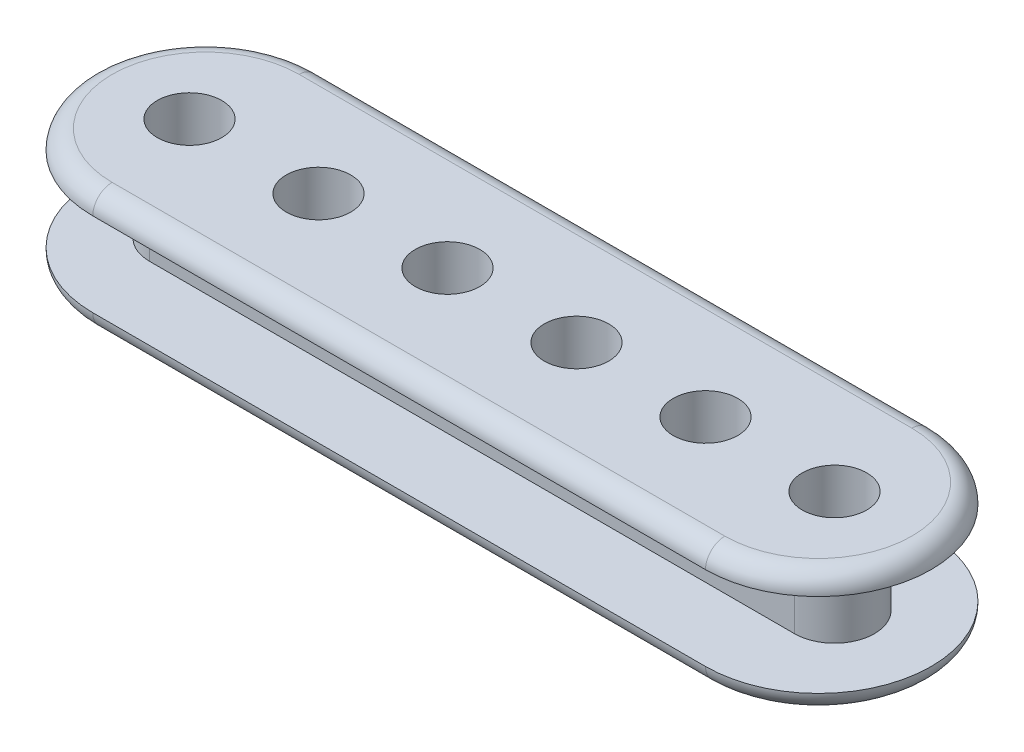
ISO-10303-21;
HEADER;
FILE_DESCRIPTION(('STEP AP214'),'2;1');
FILE_NAME('part.step','',(''),(''),'','','');
FILE_SCHEMA(('AUTOMOTIVE_DESIGN { 1 0 10303 214 1 1 1 1 }'));
ENDSEC;
DATA;
#1=APPLICATION_CONTEXT('core data for automotive mechanical design processes');
#2=APPLICATION_PROTOCOL_DEFINITION('international standard','automotive_design',2000,#1);
#3=PRODUCT_CONTEXT('',#1,'mechanical');
#4=PRODUCT('Part','Part','',(#3));
#5=PRODUCT_RELATED_PRODUCT_CATEGORY('part','',(#4));
#6=PRODUCT_DEFINITION_FORMATION('','',#4);
#7=PRODUCT_DEFINITION_CONTEXT('part definition',#1,'design');
#8=PRODUCT_DEFINITION('design','',#6,#7);
#9=PRODUCT_DEFINITION_SHAPE('','',#8);
#10=(LENGTH_UNIT() NAMED_UNIT(*) SI_UNIT(.MILLI.,.METRE.));
#11=(NAMED_UNIT(*) PLANE_ANGLE_UNIT() SI_UNIT($,.RADIAN.));
#12=(NAMED_UNIT(*) SI_UNIT($,.STERADIAN.) SOLID_ANGLE_UNIT());
#13=UNCERTAINTY_MEASURE_WITH_UNIT(LENGTH_MEASURE(1.E-05),#10,'distance_accuracy_value','');
#14=(GEOMETRIC_REPRESENTATION_CONTEXT(3) GLOBAL_UNCERTAINTY_ASSIGNED_CONTEXT((#13)) GLOBAL_UNIT_ASSIGNED_CONTEXT((#10,
#11,#12)) REPRESENTATION_CONTEXT('',''));
#15=CARTESIAN_POINT('',(0.,0.,0.));
#16=DIRECTION('',(0.,0.,1.));
#17=DIRECTION('',(1.,0.,0.));
#18=AXIS2_PLACEMENT_3D('',#15,#16,#17);
#19=CARTESIAN_POINT('',(24.13,1.524,0.));
#20=DIRECTION('',(0.,1.,0.));
#21=DIRECTION('',(0.,0.,1.));
#22=AXIS2_PLACEMENT_3D('',#19,#20,#21);
#23=PLANE('',#22);
#24=DIRECTION('',(1.,0.,0.));
#25=VECTOR('',#24,1.);
#26=CARTESIAN_POINT('',(0.,1.524,3.1496));
#27=LINE('',#26,#25);
#28=CARTESIAN_POINT('',(-25.4,1.524,3.1496));
#29=VERTEX_POINT('',#28);
#30=CARTESIAN_POINT('',(25.4,1.524,3.1496));
#31=VERTEX_POINT('',#30);
#32=EDGE_CURVE('E230',#29,#31,#27,.T.);
#33=ORIENTED_EDGE('',*,*,#32,.F.);
#34=CARTESIAN_POINT('',(-25.4,1.524,0.));
#35=DIRECTION('',(0.,1.,0.));
#36=DIRECTION('',(0.,0.,1.));
#37=AXIS2_PLACEMENT_3D('',#34,#35,#36);
#38=CIRCLE('',#37,3.1496);
#39=CARTESIAN_POINT('',(-25.4,1.524,-3.1496));
#40=VERTEX_POINT('',#39);
#41=EDGE_CURVE('E236',#40,#29,#38,.T.);
#42=ORIENTED_EDGE('',*,*,#41,.F.);
#43=DIRECTION('',(1.,0.,0.));
#44=VECTOR('',#43,1.);
#45=CARTESIAN_POINT('',(0.,1.524,-3.1496));
#46=LINE('',#45,#44);
#47=CARTESIAN_POINT('',(25.4,1.524,-3.1496));
#48=VERTEX_POINT('',#47);
#49=EDGE_CURVE('E256',#40,#48,#46,.T.);
#50=ORIENTED_EDGE('',*,*,#49,.T.);
#51=CARTESIAN_POINT('',(25.4,1.524,0.));
#52=DIRECTION('',(0.,1.,0.));
#53=DIRECTION('',(0.,0.,1.));
#54=AXIS2_PLACEMENT_3D('',#51,#52,#53);
#55=CIRCLE('',#54,3.1496);
#56=EDGE_CURVE('E252',#31,#48,#55,.T.);
#57=ORIENTED_EDGE('',*,*,#56,.F.);
#58=EDGE_LOOP('',(#33,#42,#50,#57));
#59=FACE_BOUND('',#58,.T.);
#60=CARTESIAN_POINT('',(24.13,1.524,0.));
#61=DIRECTION('',(0.,1.,0.));
#62=DIRECTION('',(0.,0.,1.));
#63=AXIS2_PLACEMENT_3D('',#60,#61,#62);
#64=CIRCLE('',#63,8.89);
#65=CARTESIAN_POINT('',(24.13,1.524,8.88999999999999));
#66=VERTEX_POINT('',#65);
#67=CARTESIAN_POINT('',(24.13,1.524,-8.89000000000001));
#68=VERTEX_POINT('',#67);
#69=EDGE_CURVE('E277',#66,#68,#64,.T.);
#70=ORIENTED_EDGE('',*,*,#69,.T.);
#71=DIRECTION('',(-1.,0.,0.));
#72=VECTOR('',#71,1.);
#73=CARTESIAN_POINT('',(24.13,1.524,-8.89000000000001));
#74=LINE('',#73,#72);
#75=CARTESIAN_POINT('',(-24.13,1.524,-8.89));
#76=VERTEX_POINT('',#75);
#77=EDGE_CURVE('E281',#68,#76,#74,.T.);
#78=ORIENTED_EDGE('',*,*,#77,.T.);
#79=CARTESIAN_POINT('',(-24.13,1.524,0.));
#80=DIRECTION('',(0.,1.,0.));
#81=DIRECTION('',(0.,0.,1.));
#82=AXIS2_PLACEMENT_3D('',#79,#80,#81);
#83=CIRCLE('',#82,8.89);
#84=CARTESIAN_POINT('',(-24.13,1.524,8.89));
#85=VERTEX_POINT('',#84);
#86=EDGE_CURVE('E284',#76,#85,#83,.T.);
#87=ORIENTED_EDGE('',*,*,#86,.T.);
#88=DIRECTION('',(1.,0.,0.));
#89=VECTOR('',#88,1.);
#90=CARTESIAN_POINT('',(24.13,1.524,8.88999999999999));
#91=LINE('',#90,#89);
#92=EDGE_CURVE('E287',#85,#66,#91,.T.);
#93=ORIENTED_EDGE('',*,*,#92,.T.);
#94=EDGE_LOOP('',(#70,#78,#87,#93));
#95=FACE_BOUND('',#94,.T.);
#96=ADVANCED_FACE('F41',(#59,#95),#23,.T.);
#97=CARTESIAN_POINT('',(24.13,0.,0.));
#98=DIRECTION('',(0.,1.,0.));
#99=DIRECTION('',(0.,0.,1.));
#100=AXIS2_PLACEMENT_3D('',#97,#98,#99);
#101=PLANE('',#100);
#102=CARTESIAN_POINT('',(-25.4,0.,0.));
#103=DIRECTION('',(0.,1.,0.));
#104=DIRECTION('',(0.,0.,1.));
#105=AXIS2_PLACEMENT_3D('',#102,#103,#104);
#106=CIRCLE('',#105,2.54);
#107=CARTESIAN_POINT('',(-25.4,0.,2.54));
#108=VERTEX_POINT('',#107);
#109=EDGE_CURVE('E175',#108,#108,#106,.T.);
#110=ORIENTED_EDGE('',*,*,#109,.T.);
#111=EDGE_LOOP('',(#110));
#112=FACE_BOUND('',#111,.T.);
#113=CARTESIAN_POINT('',(-15.24,0.,0.));
#114=DIRECTION('',(0.,1.,0.));
#115=DIRECTION('',(0.,0.,1.));
#116=AXIS2_PLACEMENT_3D('',#113,#114,#115);
#117=CIRCLE('',#116,2.54);
#118=CARTESIAN_POINT('',(-15.24,0.,2.54));
#119=VERTEX_POINT('',#118);
#120=EDGE_CURVE('E536',#119,#119,#117,.T.);
#121=ORIENTED_EDGE('',*,*,#120,.T.);
#122=EDGE_LOOP('',(#121));
#123=FACE_BOUND('',#122,.T.);
#124=CARTESIAN_POINT('',(-5.07999999999999,0.,0.));
#125=DIRECTION('',(0.,1.,0.));
#126=DIRECTION('',(0.,0.,1.));
#127=AXIS2_PLACEMENT_3D('',#124,#125,#126);
#128=CIRCLE('',#127,2.54);
#129=CARTESIAN_POINT('',(-5.07999999999999,0.,2.54));
#130=VERTEX_POINT('',#129);
#131=EDGE_CURVE('E540',#130,#130,#128,.T.);
#132=ORIENTED_EDGE('',*,*,#131,.T.);
#133=EDGE_LOOP('',(#132));
#134=FACE_BOUND('',#133,.T.);
#135=CARTESIAN_POINT('',(5.08,0.,0.));
#136=DIRECTION('',(0.,1.,0.));
#137=DIRECTION('',(0.,0.,1.));
#138=AXIS2_PLACEMENT_3D('',#135,#136,#137);
#139=CIRCLE('',#138,2.54);
#140=CARTESIAN_POINT('',(5.08,0.,2.54));
#141=VERTEX_POINT('',#140);
#142=EDGE_CURVE('E221',#141,#141,#139,.T.);
#143=ORIENTED_EDGE('',*,*,#142,.T.);
#144=EDGE_LOOP('',(#143));
#145=FACE_BOUND('',#144,.T.);
#146=CARTESIAN_POINT('',(15.24,0.,0.));
#147=DIRECTION('',(0.,1.,0.));
#148=DIRECTION('',(0.,0.,1.));
#149=AXIS2_PLACEMENT_3D('',#146,#147,#148);
#150=CIRCLE('',#149,2.54);
#151=CARTESIAN_POINT('',(15.24,0.,2.54));
#152=VERTEX_POINT('',#151);
#153=EDGE_CURVE('E217',#152,#152,#150,.T.);
#154=ORIENTED_EDGE('',*,*,#153,.T.);
#155=EDGE_LOOP('',(#154));
#156=FACE_BOUND('',#155,.T.);
#157=CARTESIAN_POINT('',(25.4,0.,0.));
#158=DIRECTION('',(0.,1.,0.));
#159=DIRECTION('',(0.,0.,1.));
#160=AXIS2_PLACEMENT_3D('',#157,#158,#159);
#161=CIRCLE('',#160,2.54);
#162=CARTESIAN_POINT('',(25.4,0.,2.54));
#163=VERTEX_POINT('',#162);
#164=EDGE_CURVE('E214',#163,#163,#161,.T.);
#165=ORIENTED_EDGE('',*,*,#164,.T.);
#166=EDGE_LOOP('',(#165));
#167=FACE_BOUND('',#166,.T.);
#168=DIRECTION('',(-1.,0.,0.));
#169=VECTOR('',#168,1.);
#170=CARTESIAN_POINT('',(24.13,0.,-7.36600000000001));
#171=LINE('',#170,#169);
#172=CARTESIAN_POINT('',(-24.13,0.,-7.366));
#173=VERTEX_POINT('',#172);
#174=CARTESIAN_POINT('',(24.13,0.,-7.36600000000001));
#175=VERTEX_POINT('',#174);
#176=EDGE_CURVE('E296',#173,#175,#171,.F.);
#177=ORIENTED_EDGE('',*,*,#176,.T.);
#178=CARTESIAN_POINT('',(24.13,0.,0.));
#179=DIRECTION('',(0.,1.,0.));
#180=DIRECTION('',(0.,0.,1.));
#181=AXIS2_PLACEMENT_3D('',#178,#179,#180);
#182=CIRCLE('',#181,7.366);
#183=CARTESIAN_POINT('',(24.13,0.,7.36599999999999));
#184=VERTEX_POINT('',#183);
#185=EDGE_CURVE('E299',#175,#184,#182,.F.);
#186=ORIENTED_EDGE('',*,*,#185,.T.);
#187=DIRECTION('',(1.,0.,0.));
#188=VECTOR('',#187,1.);
#189=CARTESIAN_POINT('',(24.13,0.,7.36599999999999));
#190=LINE('',#189,#188);
#191=CARTESIAN_POINT('',(-24.13,0.,7.366));
#192=VERTEX_POINT('',#191);
#193=EDGE_CURVE('E293',#184,#192,#190,.F.);
#194=ORIENTED_EDGE('',*,*,#193,.T.);
#195=CARTESIAN_POINT('',(-24.13,0.,0.));
#196=DIRECTION('',(0.,1.,0.));
#197=DIRECTION('',(0.,0.,1.));
#198=AXIS2_PLACEMENT_3D('',#195,#196,#197);
#199=CIRCLE('',#198,7.366);
#200=EDGE_CURVE('E290',#192,#173,#199,.F.);
#201=ORIENTED_EDGE('',*,*,#200,.T.);
#202=EDGE_LOOP('',(#177,#186,#194,#201));
#203=FACE_BOUND('',#202,.T.);
#204=ADVANCED_FACE('F333',(#112,#123,#134,#145,#156,#167,#203),#101,.F.);
#205=CARTESIAN_POINT('',(0.,8.128,3.1496));
#206=DIRECTION('',(0.,0.,-1.));
#207=DIRECTION('',(-1.,0.,0.));
#208=AXIS2_PLACEMENT_3D('',#205,#206,#207);
#209=PLANE('',#208);
#210=ORIENTED_EDGE('',*,*,#32,.T.);
#211=DIRECTION('',(0.,-1.,0.));
#212=VECTOR('',#211,1.);
#213=CARTESIAN_POINT('',(25.4,8.128,3.1496));
#214=LINE('',#213,#212);
#215=CARTESIAN_POINT('',(25.4,8.128,3.1496));
#216=VERTEX_POINT('',#215);
#217=EDGE_CURVE('E273',#216,#31,#214,.T.);
#218=ORIENTED_EDGE('',*,*,#217,.F.);
#219=DIRECTION('',(1.,0.,0.));
#220=VECTOR('',#219,1.);
#221=CARTESIAN_POINT('',(0.,8.128,3.1496));
#222=LINE('',#221,#220);
#223=CARTESIAN_POINT('',(-25.4,8.128,3.1496));
#224=VERTEX_POINT('',#223);
#225=EDGE_CURVE('E231',#224,#216,#222,.T.);
#226=ORIENTED_EDGE('',*,*,#225,.F.);
#227=DIRECTION('',(0.,-1.,0.));
#228=VECTOR('',#227,1.);
#229=CARTESIAN_POINT('',(-25.4,8.128,3.1496));
#230=LINE('',#229,#228);
#231=EDGE_CURVE('E248',#224,#29,#230,.T.);
#232=ORIENTED_EDGE('',*,*,#231,.T.);
#233=EDGE_LOOP('',(#210,#218,#226,#232));
#234=FACE_BOUND('',#233,.T.);
#235=ADVANCED_FACE('F347',(#234),#209,.F.);
#236=CARTESIAN_POINT('',(25.4,8.128,0.));
#237=DIRECTION('',(0.,-1.,0.));
#238=DIRECTION('',(0.,0.,-1.));
#239=AXIS2_PLACEMENT_3D('',#236,#237,#238);
#240=CYLINDRICAL_SURFACE('',#239,3.1496);
#241=ORIENTED_EDGE('',*,*,#56,.T.);
#242=DIRECTION('',(0.,-1.,0.));
#243=VECTOR('',#242,1.);
#244=CARTESIAN_POINT('',(25.4,8.128,-3.1496));
#245=LINE('',#244,#243);
#246=CARTESIAN_POINT('',(25.4,8.128,-3.1496));
#247=VERTEX_POINT('',#246);
#248=EDGE_CURVE('E269',#247,#48,#245,.T.);
#249=ORIENTED_EDGE('',*,*,#248,.F.);
#250=CARTESIAN_POINT('',(25.4,8.128,0.));
#251=DIRECTION('',(0.,1.,0.));
#252=DIRECTION('',(0.,0.,1.));
#253=AXIS2_PLACEMENT_3D('',#250,#251,#252);
#254=CIRCLE('',#253,3.1496);
#255=EDGE_CURVE('E235',#216,#247,#254,.T.);
#256=ORIENTED_EDGE('',*,*,#255,.F.);
#257=ORIENTED_EDGE('',*,*,#217,.T.);
#258=EDGE_LOOP('',(#241,#249,#256,#257));
#259=FACE_BOUND('',#258,.T.);
#260=ADVANCED_FACE('F419',(#259),#240,.T.);
#261=CARTESIAN_POINT('',(0.,8.128,-3.1496));
#262=DIRECTION('',(0.,0.,-1.));
#263=DIRECTION('',(-1.,0.,0.));
#264=AXIS2_PLACEMENT_3D('',#261,#262,#263);
#265=PLANE('',#264);
#266=ORIENTED_EDGE('',*,*,#49,.F.);
#267=DIRECTION('',(0.,-1.,0.));
#268=VECTOR('',#267,1.);
#269=CARTESIAN_POINT('',(-25.4,8.128,-3.1496));
#270=LINE('',#269,#268);
#271=CARTESIAN_POINT('',(-25.4,8.128,-3.1496));
#272=VERTEX_POINT('',#271);
#273=EDGE_CURVE('E265',#272,#40,#270,.T.);
#274=ORIENTED_EDGE('',*,*,#273,.F.);
#275=DIRECTION('',(1.,0.,0.));
#276=VECTOR('',#275,1.);
#277=CARTESIAN_POINT('',(0.,8.128,-3.1496));
#278=LINE('',#277,#276);
#279=EDGE_CURVE('E240',#272,#247,#278,.T.);
#280=ORIENTED_EDGE('',*,*,#279,.T.);
#281=ORIENTED_EDGE('',*,*,#248,.T.);
#282=EDGE_LOOP('',(#266,#274,#280,#281));
#283=FACE_BOUND('',#282,.T.);
#284=ADVANCED_FACE('F411',(#283),#265,.T.);
#285=CARTESIAN_POINT('',(-25.4,8.128,0.));
#286=DIRECTION('',(0.,-1.,0.));
#287=DIRECTION('',(0.,0.,-1.));
#288=AXIS2_PLACEMENT_3D('',#285,#286,#287);
#289=CYLINDRICAL_SURFACE('',#288,3.1496);
#290=ORIENTED_EDGE('',*,*,#41,.T.);
#291=ORIENTED_EDGE('',*,*,#231,.F.);
#292=CARTESIAN_POINT('',(-25.4,8.128,0.));
#293=DIRECTION('',(0.,1.,0.));
#294=DIRECTION('',(0.,0.,1.));
#295=AXIS2_PLACEMENT_3D('',#292,#293,#294);
#296=CIRCLE('',#295,3.1496);
#297=EDGE_CURVE('E244',#272,#224,#296,.T.);
#298=ORIENTED_EDGE('',*,*,#297,.F.);
#299=ORIENTED_EDGE('',*,*,#273,.T.);
#300=EDGE_LOOP('',(#290,#291,#298,#299));
#301=FACE_BOUND('',#300,.T.);
#302=ADVANCED_FACE('F403',(#301),#289,.T.);
#303=CARTESIAN_POINT('',(24.13,8.128,0.));
#304=DIRECTION('',(0.,1.,0.));
#305=DIRECTION('',(0.,0.,1.));
#306=AXIS2_PLACEMENT_3D('',#303,#304,#305);
#307=PLANE('',#306);
#308=ORIENTED_EDGE('',*,*,#297,.T.);
#309=ORIENTED_EDGE('',*,*,#225,.T.);
#310=ORIENTED_EDGE('',*,*,#255,.T.);
#311=ORIENTED_EDGE('',*,*,#279,.F.);
#312=EDGE_LOOP('',(#308,#309,#310,#311));
#313=FACE_BOUND('',#312,.T.);
#314=CARTESIAN_POINT('',(24.13,8.128,0.));
#315=DIRECTION('',(0.,1.,0.));
#316=DIRECTION('',(0.,0.,1.));
#317=AXIS2_PLACEMENT_3D('',#314,#315,#316);
#318=CIRCLE('',#317,8.89);
#319=CARTESIAN_POINT('',(24.13,8.128,8.88999999999999));
#320=VERTEX_POINT('',#319);
#321=CARTESIAN_POINT('',(24.13,8.128,-8.89000000000001));
#322=VERTEX_POINT('',#321);
#323=EDGE_CURVE('E136',#320,#322,#318,.T.);
#324=ORIENTED_EDGE('',*,*,#323,.F.);
#325=DIRECTION('',(1.,0.,0.));
#326=VECTOR('',#325,1.);
#327=CARTESIAN_POINT('',(-24.13,8.128,8.89));
#328=LINE('',#327,#326);
#329=CARTESIAN_POINT('',(-24.13,8.128,8.89));
#330=VERTEX_POINT('',#329);
#331=EDGE_CURVE('E227',#330,#320,#328,.T.);
#332=ORIENTED_EDGE('',*,*,#331,.F.);
#333=CARTESIAN_POINT('',(-24.13,8.128,0.));
#334=DIRECTION('',(0.,1.,0.));
#335=DIRECTION('',(0.,0.,1.));
#336=AXIS2_PLACEMENT_3D('',#333,#334,#335);
#337=CIRCLE('',#336,8.89);
#338=CARTESIAN_POINT('',(-24.13,8.128,-8.89));
#339=VERTEX_POINT('',#338);
#340=EDGE_CURVE('E138',#339,#330,#337,.T.);
#341=ORIENTED_EDGE('',*,*,#340,.F.);
#342=DIRECTION('',(-1.,0.,0.));
#343=VECTOR('',#342,1.);
#344=CARTESIAN_POINT('',(24.13,8.128,-8.89000000000001));
#345=LINE('',#344,#343);
#346=EDGE_CURVE('E134',#322,#339,#345,.T.);
#347=ORIENTED_EDGE('',*,*,#346,.F.);
#348=EDGE_LOOP('',(#324,#332,#341,#347));
#349=FACE_BOUND('',#348,.T.);
#350=ADVANCED_FACE('F135',(#313,#349),#307,.F.);
#351=CARTESIAN_POINT('',(24.13,9.652,0.));
#352=DIRECTION('',(0.,1.,0.));
#353=DIRECTION('',(0.,0.,1.));
#354=AXIS2_PLACEMENT_3D('',#351,#352,#353);
#355=PLANE('',#354);
#356=CARTESIAN_POINT('',(-25.4,9.652,0.));
#357=DIRECTION('',(0.,1.,0.));
#358=DIRECTION('',(0.,0.,1.));
#359=AXIS2_PLACEMENT_3D('',#356,#357,#358);
#360=CIRCLE('',#359,2.54);
#361=CARTESIAN_POINT('',(-25.4,9.652,2.54));
#362=VERTEX_POINT('',#361);
#363=EDGE_CURVE('E45',#362,#362,#360,.T.);
#364=ORIENTED_EDGE('',*,*,#363,.F.);
#365=EDGE_LOOP('',(#364));
#366=FACE_BOUND('',#365,.T.);
#367=CARTESIAN_POINT('',(-15.24,9.652,0.));
#368=DIRECTION('',(0.,1.,0.));
#369=DIRECTION('',(0.,0.,1.));
#370=AXIS2_PLACEMENT_3D('',#367,#368,#369);
#371=CIRCLE('',#370,2.54);
#372=CARTESIAN_POINT('',(-15.24,9.652,2.54));
#373=VERTEX_POINT('',#372);
#374=EDGE_CURVE('E159',#373,#373,#371,.T.);
#375=ORIENTED_EDGE('',*,*,#374,.F.);
#376=EDGE_LOOP('',(#375));
#377=FACE_BOUND('',#376,.T.);
#378=CARTESIAN_POINT('',(-5.07999999999999,9.652,0.));
#379=DIRECTION('',(0.,1.,0.));
#380=DIRECTION('',(0.,0.,1.));
#381=AXIS2_PLACEMENT_3D('',#378,#379,#380);
#382=CIRCLE('',#381,2.54);
#383=CARTESIAN_POINT('',(-5.07999999999999,9.652,2.54));
#384=VERTEX_POINT('',#383);
#385=EDGE_CURVE('E183',#384,#384,#382,.T.);
#386=ORIENTED_EDGE('',*,*,#385,.F.);
#387=EDGE_LOOP('',(#386));
#388=FACE_BOUND('',#387,.T.);
#389=CARTESIAN_POINT('',(5.08,9.652,0.));
#390=DIRECTION('',(0.,1.,0.));
#391=DIRECTION('',(0.,0.,1.));
#392=AXIS2_PLACEMENT_3D('',#389,#390,#391);
#393=CIRCLE('',#392,2.54);
#394=CARTESIAN_POINT('',(5.08,9.652,2.54));
#395=VERTEX_POINT('',#394);
#396=EDGE_CURVE('E179',#395,#395,#393,.T.);
#397=ORIENTED_EDGE('',*,*,#396,.F.);
#398=EDGE_LOOP('',(#397));
#399=FACE_BOUND('',#398,.T.);
#400=CARTESIAN_POINT('',(15.24,9.652,0.));
#401=DIRECTION('',(0.,1.,0.));
#402=DIRECTION('',(0.,0.,1.));
#403=AXIS2_PLACEMENT_3D('',#400,#401,#402);
#404=CIRCLE('',#403,2.54);
#405=CARTESIAN_POINT('',(15.24,9.652,2.54));
#406=VERTEX_POINT('',#405);
#407=EDGE_CURVE('E174',#406,#406,#404,.T.);
#408=ORIENTED_EDGE('',*,*,#407,.F.);
#409=EDGE_LOOP('',(#408));
#410=FACE_BOUND('',#409,.T.);
#411=CARTESIAN_POINT('',(25.4,9.652,0.));
#412=DIRECTION('',(0.,1.,0.));
#413=DIRECTION('',(0.,0.,1.));
#414=AXIS2_PLACEMENT_3D('',#411,#412,#413);
#415=CIRCLE('',#414,2.54);
#416=CARTESIAN_POINT('',(25.4,9.652,2.54));
#417=VERTEX_POINT('',#416);
#418=EDGE_CURVE('E170',#417,#417,#415,.T.);
#419=ORIENTED_EDGE('',*,*,#418,.F.);
#420=EDGE_LOOP('',(#419));
#421=FACE_BOUND('',#420,.T.);
#422=DIRECTION('',(1.,0.,0.));
#423=VECTOR('',#422,1.);
#424=CARTESIAN_POINT('',(24.13,9.652,7.36599999999999));
#425=LINE('',#424,#423);
#426=CARTESIAN_POINT('',(-24.13,9.652,7.366));
#427=VERTEX_POINT('',#426);
#428=CARTESIAN_POINT('',(24.13,9.652,7.36599999999999));
#429=VERTEX_POINT('',#428);
#430=EDGE_CURVE('E51',#427,#429,#425,.T.);
#431=ORIENTED_EDGE('',*,*,#430,.T.);
#432=CARTESIAN_POINT('',(24.13,9.652,0.));
#433=DIRECTION('',(0.,1.,0.));
#434=DIRECTION('',(0.,0.,1.));
#435=AXIS2_PLACEMENT_3D('',#432,#433,#434);
#436=CIRCLE('',#435,7.366);
#437=CARTESIAN_POINT('',(24.13,9.652,-7.36600000000001));
#438=VERTEX_POINT('',#437);
#439=EDGE_CURVE('E11',#429,#438,#436,.T.);
#440=ORIENTED_EDGE('',*,*,#439,.T.);
#441=DIRECTION('',(-1.,0.,0.));
#442=VECTOR('',#441,1.);
#443=CARTESIAN_POINT('',(-24.13,9.652,-7.366));
#444=LINE('',#443,#442);
#445=CARTESIAN_POINT('',(-24.13,9.652,-7.366));
#446=VERTEX_POINT('',#445);
#447=EDGE_CURVE('E151',#438,#446,#444,.T.);
#448=ORIENTED_EDGE('',*,*,#447,.T.);
#449=CARTESIAN_POINT('',(-24.13,9.652,0.));
#450=DIRECTION('',(0.,1.,0.));
#451=DIRECTION('',(0.,0.,1.));
#452=AXIS2_PLACEMENT_3D('',#449,#450,#451);
#453=CIRCLE('',#452,7.366);
#454=EDGE_CURVE('E303',#446,#427,#453,.T.);
#455=ORIENTED_EDGE('',*,*,#454,.T.);
#456=EDGE_LOOP('',(#431,#440,#448,#455));
#457=FACE_BOUND('',#456,.T.);
#458=ADVANCED_FACE('F193',(#366,#377,#388,#399,#410,#421,#457),#355,.T.);
#459=CARTESIAN_POINT('',(-24.13,1.524,0.));
#460=DIRECTION('',(0.,1.,0.));
#461=DIRECTION('',(0.,0.,1.));
#462=AXIS2_PLACEMENT_3D('',#459,#460,#461);
#463=TOROIDAL_SURFACE('',#462,7.366,1.524);
#464=CARTESIAN_POINT('',(-24.13,1.524,-7.366));
#465=DIRECTION('',(1.,0.,0.));
#466=DIRECTION('',(0.,0.,-1.));
#467=AXIS2_PLACEMENT_3D('',#464,#465,#466);
#468=CIRCLE('',#467,1.524);
#469=EDGE_CURVE('E314',#173,#76,#468,.T.);
#470=ORIENTED_EDGE('',*,*,#469,.F.);
#471=ORIENTED_EDGE('',*,*,#200,.F.);
#472=CARTESIAN_POINT('',(-24.13,1.524,7.366));
#473=DIRECTION('',(1.,0.,0.));
#474=DIRECTION('',(0.,0.,-1.));
#475=AXIS2_PLACEMENT_3D('',#472,#473,#474);
#476=CIRCLE('',#475,1.524);
#477=EDGE_CURVE('E148',#85,#192,#476,.T.);
#478=ORIENTED_EDGE('',*,*,#477,.F.);
#479=ORIENTED_EDGE('',*,*,#86,.F.);
#480=EDGE_LOOP('',(#470,#471,#478,#479));
#481=FACE_BOUND('',#480,.T.);
#482=ADVANCED_FACE('F196',(#481),#463,.T.);
#483=CARTESIAN_POINT('',(24.13,1.524,7.36599999999999));
#484=DIRECTION('',(1.,0.,0.));
#485=DIRECTION('',(0.,0.,-1.));
#486=AXIS2_PLACEMENT_3D('',#483,#484,#485);
#487=CYLINDRICAL_SURFACE('',#486,1.524);
#488=ORIENTED_EDGE('',*,*,#477,.T.);
#489=ORIENTED_EDGE('',*,*,#193,.F.);
#490=CARTESIAN_POINT('',(24.13,1.524,7.36599999999999));
#491=DIRECTION('',(1.,0.,0.));
#492=DIRECTION('',(0.,0.,-1.));
#493=AXIS2_PLACEMENT_3D('',#490,#491,#492);
#494=CIRCLE('',#493,1.524);
#495=EDGE_CURVE('E312',#66,#184,#494,.T.);
#496=ORIENTED_EDGE('',*,*,#495,.F.);
#497=ORIENTED_EDGE('',*,*,#92,.F.);
#498=EDGE_LOOP('',(#488,#489,#496,#497));
#499=FACE_BOUND('',#498,.T.);
#500=ADVANCED_FACE('F327',(#499),#487,.T.);
#501=CARTESIAN_POINT('',(24.13,1.524,-7.36600000000001));
#502=DIRECTION('',(-1.,0.,0.));
#503=DIRECTION('',(0.,0.,1.));
#504=AXIS2_PLACEMENT_3D('',#501,#502,#503);
#505=CYLINDRICAL_SURFACE('',#504,1.524);
#506=ORIENTED_EDGE('',*,*,#469,.T.);
#507=ORIENTED_EDGE('',*,*,#77,.F.);
#508=CARTESIAN_POINT('',(24.13,1.524,-7.36600000000001));
#509=DIRECTION('',(1.,0.,0.));
#510=DIRECTION('',(0.,0.,-1.));
#511=AXIS2_PLACEMENT_3D('',#508,#509,#510);
#512=CIRCLE('',#511,1.524);
#513=EDGE_CURVE('E169',#175,#68,#512,.T.);
#514=ORIENTED_EDGE('',*,*,#513,.F.);
#515=ORIENTED_EDGE('',*,*,#176,.F.);
#516=EDGE_LOOP('',(#506,#507,#514,#515));
#517=FACE_BOUND('',#516,.T.);
#518=ADVANCED_FACE('F339',(#517),#505,.T.);
#519=CARTESIAN_POINT('',(24.13,1.524,0.));
#520=DIRECTION('',(0.,1.,0.));
#521=DIRECTION('',(0.,0.,1.));
#522=AXIS2_PLACEMENT_3D('',#519,#520,#521);
#523=TOROIDAL_SURFACE('',#522,7.366,1.524);
#524=ORIENTED_EDGE('',*,*,#495,.T.);
#525=ORIENTED_EDGE('',*,*,#185,.F.);
#526=ORIENTED_EDGE('',*,*,#513,.T.);
#527=ORIENTED_EDGE('',*,*,#69,.F.);
#528=EDGE_LOOP('',(#524,#525,#526,#527));
#529=FACE_BOUND('',#528,.T.);
#530=ADVANCED_FACE('F337',(#529),#523,.T.);
#531=CARTESIAN_POINT('',(-24.13,8.128,0.));
#532=DIRECTION('',(0.,1.,0.));
#533=DIRECTION('',(0.,0.,1.));
#534=AXIS2_PLACEMENT_3D('',#531,#532,#533);
#535=TOROIDAL_SURFACE('',#534,7.366,1.524);
#536=CARTESIAN_POINT('',(-24.13,8.128,-7.366));
#537=DIRECTION('',(1.,0.,0.));
#538=DIRECTION('',(0.,0.,-1.));
#539=AXIS2_PLACEMENT_3D('',#536,#537,#538);
#540=CIRCLE('',#539,1.524);
#541=EDGE_CURVE('E156',#339,#446,#540,.T.);
#542=ORIENTED_EDGE('',*,*,#541,.F.);
#543=ORIENTED_EDGE('',*,*,#340,.T.);
#544=CARTESIAN_POINT('',(-24.13,8.128,7.366));
#545=DIRECTION('',(1.,0.,0.));
#546=DIRECTION('',(0.,0.,-1.));
#547=AXIS2_PLACEMENT_3D('',#544,#545,#546);
#548=CIRCLE('',#547,1.524);
#549=EDGE_CURVE('E165',#427,#330,#548,.T.);
#550=ORIENTED_EDGE('',*,*,#549,.F.);
#551=ORIENTED_EDGE('',*,*,#454,.F.);
#552=EDGE_LOOP('',(#542,#543,#550,#551));
#553=FACE_BOUND('',#552,.T.);
#554=ADVANCED_FACE('F43',(#553),#535,.T.);
#555=CARTESIAN_POINT('',(24.13,8.128,7.36599999999999));
#556=DIRECTION('',(-1.,0.,0.));
#557=DIRECTION('',(0.,0.,1.));
#558=AXIS2_PLACEMENT_3D('',#555,#556,#557);
#559=CYLINDRICAL_SURFACE('',#558,1.524);
#560=ORIENTED_EDGE('',*,*,#549,.T.);
#561=ORIENTED_EDGE('',*,*,#331,.T.);
#562=CARTESIAN_POINT('',(24.13,8.128,7.36599999999999));
#563=DIRECTION('',(1.,0.,0.));
#564=DIRECTION('',(0.,0.,-1.));
#565=AXIS2_PLACEMENT_3D('',#562,#563,#564);
#566=CIRCLE('',#565,1.524);
#567=EDGE_CURVE('E145',#429,#320,#566,.T.);
#568=ORIENTED_EDGE('',*,*,#567,.F.);
#569=ORIENTED_EDGE('',*,*,#430,.F.);
#570=EDGE_LOOP('',(#560,#561,#568,#569));
#571=FACE_BOUND('',#570,.T.);
#572=ADVANCED_FACE('F364',(#571),#559,.T.);
#573=CARTESIAN_POINT('',(24.13,8.128,-7.36600000000001));
#574=DIRECTION('',(1.,0.,0.));
#575=DIRECTION('',(0.,0.,-1.));
#576=AXIS2_PLACEMENT_3D('',#573,#574,#575);
#577=CYLINDRICAL_SURFACE('',#576,1.524);
#578=ORIENTED_EDGE('',*,*,#541,.T.);
#579=ORIENTED_EDGE('',*,*,#447,.F.);
#580=CARTESIAN_POINT('',(24.13,8.128,-7.366));
#581=DIRECTION('',(1.,0.,0.));
#582=DIRECTION('',(0.,0.,-1.));
#583=AXIS2_PLACEMENT_3D('',#580,#581,#582);
#584=CIRCLE('',#583,1.524);
#585=EDGE_CURVE('E65',#322,#438,#584,.T.);
#586=ORIENTED_EDGE('',*,*,#585,.F.);
#587=ORIENTED_EDGE('',*,*,#346,.T.);
#588=EDGE_LOOP('',(#578,#579,#586,#587));
#589=FACE_BOUND('',#588,.T.);
#590=ADVANCED_FACE('F150',(#589),#577,.T.);
#591=CARTESIAN_POINT('',(24.13,8.128,0.));
#592=DIRECTION('',(0.,1.,0.));
#593=DIRECTION('',(0.,0.,1.));
#594=AXIS2_PLACEMENT_3D('',#591,#592,#593);
#595=TOROIDAL_SURFACE('',#594,7.366,1.524);
#596=ORIENTED_EDGE('',*,*,#567,.T.);
#597=ORIENTED_EDGE('',*,*,#323,.T.);
#598=ORIENTED_EDGE('',*,*,#585,.T.);
#599=ORIENTED_EDGE('',*,*,#439,.F.);
#600=EDGE_LOOP('',(#596,#597,#598,#599));
#601=FACE_BOUND('',#600,.T.);
#602=ADVANCED_FACE('F144',(#601),#595,.T.);
#603=CARTESIAN_POINT('',(25.4,0.,0.));
#604=DIRECTION('',(0.,1.,0.));
#605=DIRECTION('',(0.,0.,1.));
#606=AXIS2_PLACEMENT_3D('',#603,#604,#605);
#607=CYLINDRICAL_SURFACE('',#606,2.54);
#608=ORIENTED_EDGE('',*,*,#418,.T.);
#609=EDGE_LOOP('',(#608));
#610=FACE_BOUND('',#609,.T.);
#611=ORIENTED_EDGE('',*,*,#164,.F.);
#612=EDGE_LOOP('',(#611));
#613=FACE_BOUND('',#612,.T.);
#614=ADVANCED_FACE('F207',(#610,#613),#607,.F.);
#615=CARTESIAN_POINT('',(15.24,0.,0.));
#616=DIRECTION('',(0.,1.,0.));
#617=DIRECTION('',(0.,0.,1.));
#618=AXIS2_PLACEMENT_3D('',#615,#616,#617);
#619=CYLINDRICAL_SURFACE('',#618,2.54);
#620=ORIENTED_EDGE('',*,*,#407,.T.);
#621=EDGE_LOOP('',(#620));
#622=FACE_BOUND('',#621,.T.);
#623=ORIENTED_EDGE('',*,*,#153,.F.);
#624=EDGE_LOOP('',(#623));
#625=FACE_BOUND('',#624,.T.);
#626=ADVANCED_FACE('F210',(#622,#625),#619,.F.);
#627=CARTESIAN_POINT('',(5.08,0.,0.));
#628=DIRECTION('',(0.,1.,0.));
#629=DIRECTION('',(0.,0.,1.));
#630=AXIS2_PLACEMENT_3D('',#627,#628,#629);
#631=CYLINDRICAL_SURFACE('',#630,2.54);
#632=ORIENTED_EDGE('',*,*,#396,.T.);
#633=EDGE_LOOP('',(#632));
#634=FACE_BOUND('',#633,.T.);
#635=ORIENTED_EDGE('',*,*,#142,.F.);
#636=EDGE_LOOP('',(#635));
#637=FACE_BOUND('',#636,.T.);
#638=ADVANCED_FACE('F486',(#634,#637),#631,.F.);
#639=CARTESIAN_POINT('',(-5.07999999999999,0.,0.));
#640=DIRECTION('',(0.,1.,0.));
#641=DIRECTION('',(0.,0.,1.));
#642=AXIS2_PLACEMENT_3D('',#639,#640,#641);
#643=CYLINDRICAL_SURFACE('',#642,2.54);
#644=ORIENTED_EDGE('',*,*,#385,.T.);
#645=EDGE_LOOP('',(#644));
#646=FACE_BOUND('',#645,.T.);
#647=ORIENTED_EDGE('',*,*,#131,.F.);
#648=EDGE_LOOP('',(#647));
#649=FACE_BOUND('',#648,.T.);
#650=ADVANCED_FACE('F494',(#646,#649),#643,.F.);
#651=CARTESIAN_POINT('',(-15.24,0.,0.));
#652=DIRECTION('',(0.,1.,0.));
#653=DIRECTION('',(0.,0.,1.));
#654=AXIS2_PLACEMENT_3D('',#651,#652,#653);
#655=CYLINDRICAL_SURFACE('',#654,2.54);
#656=ORIENTED_EDGE('',*,*,#374,.T.);
#657=EDGE_LOOP('',(#656));
#658=FACE_BOUND('',#657,.T.);
#659=ORIENTED_EDGE('',*,*,#120,.F.);
#660=EDGE_LOOP('',(#659));
#661=FACE_BOUND('',#660,.T.);
#662=ADVANCED_FACE('F190',(#658,#661),#655,.F.);
#663=CARTESIAN_POINT('',(-25.4,0.,0.));
#664=DIRECTION('',(0.,1.,0.));
#665=DIRECTION('',(0.,0.,1.));
#666=AXIS2_PLACEMENT_3D('',#663,#664,#665);
#667=CYLINDRICAL_SURFACE('',#666,2.54);
#668=ORIENTED_EDGE('',*,*,#363,.T.);
#669=EDGE_LOOP('',(#668));
#670=FACE_BOUND('',#669,.T.);
#671=ORIENTED_EDGE('',*,*,#109,.F.);
#672=EDGE_LOOP('',(#671));
#673=FACE_BOUND('',#672,.T.);
#674=ADVANCED_FACE('F509',(#670,#673),#667,.F.);
#675=CLOSED_SHELL('',(#96,#204,#235,#260,#284,#302,#350,#458,#482,#500,#518,#530,#554,#572,#590,
#602,#614,#626,#638,#650,#662,#674));
#676=MANIFOLD_SOLID_BREP('B2',#675);
#677=ADVANCED_BREP_SHAPE_REPRESENTATION('',(#18,#676),#14);
#678=SHAPE_DEFINITION_REPRESENTATION(#9,#677);
ENDSEC;
END-ISO-10303-21;
